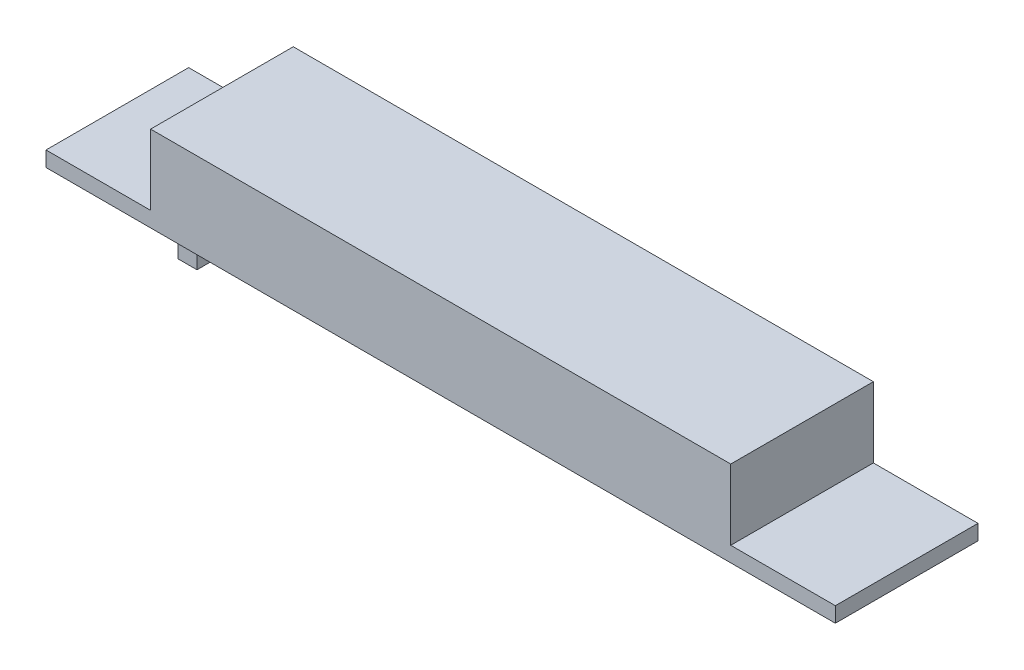
ISO-10303-21;
HEADER;
FILE_DESCRIPTION(('STEP AP214'),'2;1');
FILE_NAME('part.step','',(''),(''),'','','');
FILE_SCHEMA(('AUTOMOTIVE_DESIGN { 1 0 10303 214 1 1 1 1 }'));
ENDSEC;
DATA;
#1=APPLICATION_CONTEXT('core data for automotive mechanical design processes');
#2=APPLICATION_PROTOCOL_DEFINITION('international standard','automotive_design',2000,#1);
#3=PRODUCT_CONTEXT('',#1,'mechanical');
#4=PRODUCT('Part','Part','',(#3));
#5=PRODUCT_RELATED_PRODUCT_CATEGORY('part','',(#4));
#6=PRODUCT_DEFINITION_FORMATION('','',#4);
#7=PRODUCT_DEFINITION_CONTEXT('part definition',#1,'design');
#8=PRODUCT_DEFINITION('design','',#6,#7);
#9=PRODUCT_DEFINITION_SHAPE('','',#8);
#10=(LENGTH_UNIT() NAMED_UNIT(*) SI_UNIT(.MILLI.,.METRE.));
#11=(NAMED_UNIT(*) PLANE_ANGLE_UNIT() SI_UNIT($,.RADIAN.));
#12=(NAMED_UNIT(*) SI_UNIT($,.STERADIAN.) SOLID_ANGLE_UNIT());
#13=UNCERTAINTY_MEASURE_WITH_UNIT(LENGTH_MEASURE(1.E-05),#10,'distance_accuracy_value','');
#14=(GEOMETRIC_REPRESENTATION_CONTEXT(3) GLOBAL_UNCERTAINTY_ASSIGNED_CONTEXT((#13)) GLOBAL_UNIT_ASSIGNED_CONTEXT((#10,
#11,#12)) REPRESENTATION_CONTEXT('',''));
#15=CARTESIAN_POINT('',(0.,0.,0.));
#16=DIRECTION('',(0.,0.,1.));
#17=DIRECTION('',(1.,0.,0.));
#18=AXIS2_PLACEMENT_3D('',#15,#16,#17);
#19=CARTESIAN_POINT('',(0.,0.,0.));
#20=DIRECTION('',(0.,-1.,0.));
#21=DIRECTION('',(0.,0.,-1.));
#22=AXIS2_PLACEMENT_3D('',#19,#20,#21);
#23=PLANE('',#22);
#24=DIRECTION('',(0.,0.,-1.));
#25=VECTOR('',#24,1.);
#26=CARTESIAN_POINT('',(41.5,0.,7.5));
#27=LINE('',#26,#25);
#28=CARTESIAN_POINT('',(41.5,0.,7.5));
#29=VERTEX_POINT('',#28);
#30=CARTESIAN_POINT('',(41.5,0.,-7.5));
#31=VERTEX_POINT('',#30);
#32=EDGE_CURVE('E189',#29,#31,#27,.T.);
#33=ORIENTED_EDGE('',*,*,#32,.F.);
#34=DIRECTION('',(1.,0.,0.));
#35=VECTOR('',#34,1.);
#36=CARTESIAN_POINT('',(-41.5,0.,7.5));
#37=LINE('',#36,#35);
#38=CARTESIAN_POINT('',(-41.5,0.,7.5));
#39=VERTEX_POINT('',#38);
#40=EDGE_CURVE('E194',#39,#29,#37,.T.);
#41=ORIENTED_EDGE('',*,*,#40,.F.);
#42=DIRECTION('',(0.,0.,1.));
#43=VECTOR('',#42,1.);
#44=CARTESIAN_POINT('',(-41.5,0.,7.5));
#45=LINE('',#44,#43);
#46=CARTESIAN_POINT('',(-41.5,0.,-7.5));
#47=VERTEX_POINT('',#46);
#48=EDGE_CURVE('E207',#47,#39,#45,.T.);
#49=ORIENTED_EDGE('',*,*,#48,.F.);
#50=DIRECTION('',(-1.,0.,0.));
#51=VECTOR('',#50,1.);
#52=CARTESIAN_POINT('',(-41.5,0.,-7.5));
#53=LINE('',#52,#51);
#54=EDGE_CURVE('E205',#31,#47,#53,.T.);
#55=ORIENTED_EDGE('',*,*,#54,.F.);
#56=EDGE_LOOP('',(#33,#41,#49,#55));
#57=FACE_BOUND('',#56,.T.);
#58=DIRECTION('',(1.,0.,0.));
#59=VECTOR('',#58,1.);
#60=CARTESIAN_POINT('',(-26.5,0.,-6.62500000000001));
#61=LINE('',#60,#59);
#62=CARTESIAN_POINT('',(-28.5,0.,-6.62500000000001));
#63=VERTEX_POINT('',#62);
#64=CARTESIAN_POINT('',(-26.5,0.,-6.62500000000001));
#65=VERTEX_POINT('',#64);
#66=EDGE_CURVE('E389',#63,#65,#61,.T.);
#67=ORIENTED_EDGE('',*,*,#66,.F.);
#68=DIRECTION('',(0.,0.,-1.));
#69=VECTOR('',#68,1.);
#70=CARTESIAN_POINT('',(-28.5,0.,-6.62500000000001));
#71=LINE('',#70,#69);
#72=CARTESIAN_POINT('',(-28.5,0.,6.62499999999999));
#73=VERTEX_POINT('',#72);
#74=EDGE_CURVE('E154',#73,#63,#71,.T.);
#75=ORIENTED_EDGE('',*,*,#74,.F.);
#76=DIRECTION('',(-1.,0.,0.));
#77=VECTOR('',#76,1.);
#78=CARTESIAN_POINT('',(-26.5,0.,6.62499999999999));
#79=LINE('',#78,#77);
#80=CARTESIAN_POINT('',(-26.5,0.,6.62499999999999));
#81=VERTEX_POINT('',#80);
#82=EDGE_CURVE('E150',#81,#73,#79,.T.);
#83=ORIENTED_EDGE('',*,*,#82,.F.);
#84=DIRECTION('',(0.,0.,1.));
#85=VECTOR('',#84,1.);
#86=CARTESIAN_POINT('',(-26.5,0.,-6.62500000000001));
#87=LINE('',#86,#85);
#88=EDGE_CURVE('E386',#65,#81,#87,.T.);
#89=ORIENTED_EDGE('',*,*,#88,.F.);
#90=EDGE_LOOP('',(#67,#75,#83,#89));
#91=FACE_BOUND('',#90,.T.);
#92=ADVANCED_FACE('F41',(#57,#91),#23,.T.);
#93=CARTESIAN_POINT('',(0.,1.6,0.));
#94=DIRECTION('',(0.,-1.,0.));
#95=DIRECTION('',(0.,0.,-1.));
#96=AXIS2_PLACEMENT_3D('',#93,#94,#95);
#97=PLANE('',#96);
#98=DIRECTION('',(0.,0.,-1.));
#99=VECTOR('',#98,1.);
#100=CARTESIAN_POINT('',(30.5,1.6,7.50000000000001));
#101=LINE('',#100,#99);
#102=CARTESIAN_POINT('',(30.5,1.6,7.5));
#103=VERTEX_POINT('',#102);
#104=CARTESIAN_POINT('',(30.5,1.6,-7.5));
#105=VERTEX_POINT('',#104);
#106=EDGE_CURVE('E64',#103,#105,#101,.T.);
#107=ORIENTED_EDGE('',*,*,#106,.F.);
#108=DIRECTION('',(1.,0.,0.));
#109=VECTOR('',#108,1.);
#110=CARTESIAN_POINT('',(-41.5,1.6,7.5));
#111=LINE('',#110,#109);
#112=CARTESIAN_POINT('',(41.5,1.6,7.5));
#113=VERTEX_POINT('',#112);
#114=EDGE_CURVE('E199',#103,#113,#111,.T.);
#115=ORIENTED_EDGE('',*,*,#114,.T.);
#116=DIRECTION('',(0.,0.,-1.));
#117=VECTOR('',#116,1.);
#118=CARTESIAN_POINT('',(41.5,1.6,7.5));
#119=LINE('',#118,#117);
#120=CARTESIAN_POINT('',(41.5,1.6,-7.5));
#121=VERTEX_POINT('',#120);
#122=EDGE_CURVE('E190',#113,#121,#119,.T.);
#123=ORIENTED_EDGE('',*,*,#122,.T.);
#124=DIRECTION('',(-1.,0.,0.));
#125=VECTOR('',#124,1.);
#126=CARTESIAN_POINT('',(-41.5,1.6,-7.5));
#127=LINE('',#126,#125);
#128=EDGE_CURVE('E195',#121,#105,#127,.T.);
#129=ORIENTED_EDGE('',*,*,#128,.T.);
#130=EDGE_LOOP('',(#107,#115,#123,#129));
#131=FACE_BOUND('',#130,.T.);
#132=ADVANCED_FACE('F234',(#131),#97,.F.);
#133=DIRECTION('',(0.,0.,1.));
#134=VECTOR('',#133,1.);
#135=CARTESIAN_POINT('',(-30.5,1.6,7.5));
#136=LINE('',#135,#134);
#137=CARTESIAN_POINT('',(-30.5,1.6,-7.5));
#138=VERTEX_POINT('',#137);
#139=CARTESIAN_POINT('',(-30.5,1.6,7.5));
#140=VERTEX_POINT('',#139);
#141=EDGE_CURVE('E157',#138,#140,#136,.T.);
#142=ORIENTED_EDGE('',*,*,#141,.F.);
#143=CARTESIAN_POINT('',(-41.5,1.6,-7.5));
#144=VERTEX_POINT('',#143);
#145=EDGE_CURVE('E193',#138,#144,#127,.T.);
#146=ORIENTED_EDGE('',*,*,#145,.T.);
#147=DIRECTION('',(0.,0.,1.));
#148=VECTOR('',#147,1.);
#149=CARTESIAN_POINT('',(-41.5,1.6,7.5));
#150=LINE('',#149,#148);
#151=CARTESIAN_POINT('',(-41.5,1.6,7.5));
#152=VERTEX_POINT('',#151);
#153=EDGE_CURVE('E197',#144,#152,#150,.T.);
#154=ORIENTED_EDGE('',*,*,#153,.T.);
#155=EDGE_CURVE('E200',#152,#140,#111,.T.);
#156=ORIENTED_EDGE('',*,*,#155,.T.);
#157=EDGE_LOOP('',(#142,#146,#154,#156));
#158=FACE_BOUND('',#157,.T.);
#159=ADVANCED_FACE('F249',(#158),#97,.F.);
#160=CARTESIAN_POINT('',(41.5,1.6,7.5));
#161=DIRECTION('',(-1.,0.,0.));
#162=DIRECTION('',(0.,0.,1.));
#163=AXIS2_PLACEMENT_3D('',#160,#161,#162);
#164=PLANE('',#163);
#165=ORIENTED_EDGE('',*,*,#32,.T.);
#166=DIRECTION('',(0.,-1.,0.));
#167=VECTOR('',#166,1.);
#168=CARTESIAN_POINT('',(41.5,1.6,-7.5));
#169=LINE('',#168,#167);
#170=EDGE_CURVE('E11',#121,#31,#169,.T.);
#171=ORIENTED_EDGE('',*,*,#170,.F.);
#172=ORIENTED_EDGE('',*,*,#122,.F.);
#173=DIRECTION('',(0.,-1.,0.));
#174=VECTOR('',#173,1.);
#175=CARTESIAN_POINT('',(41.5,1.6,7.5));
#176=LINE('',#175,#174);
#177=EDGE_CURVE('E202',#113,#29,#176,.T.);
#178=ORIENTED_EDGE('',*,*,#177,.T.);
#179=EDGE_LOOP('',(#165,#171,#172,#178));
#180=FACE_BOUND('',#179,.T.);
#181=ADVANCED_FACE('F43',(#180),#164,.F.);
#182=CARTESIAN_POINT('',(-41.5,1.6,-7.5));
#183=DIRECTION('',(0.,0.,1.));
#184=DIRECTION('',(1.,0.,0.));
#185=AXIS2_PLACEMENT_3D('',#182,#183,#184);
#186=PLANE('',#185);
#187=ORIENTED_EDGE('',*,*,#54,.T.);
#188=DIRECTION('',(0.,-1.,0.));
#189=VECTOR('',#188,1.);
#190=CARTESIAN_POINT('',(-41.5,1.6,-7.5));
#191=LINE('',#190,#189);
#192=EDGE_CURVE('E49',#144,#47,#191,.T.);
#193=ORIENTED_EDGE('',*,*,#192,.F.);
#194=ORIENTED_EDGE('',*,*,#145,.F.);
#195=DIRECTION('',(0.,-1.,0.));
#196=VECTOR('',#195,1.);
#197=CARTESIAN_POINT('',(-30.5,9.,-7.5));
#198=LINE('',#197,#196);
#199=CARTESIAN_POINT('',(-30.5,9.,-7.5));
#200=VERTEX_POINT('',#199);
#201=EDGE_CURVE('E182',#200,#138,#198,.T.);
#202=ORIENTED_EDGE('',*,*,#201,.F.);
#203=DIRECTION('',(-1.,0.,0.));
#204=VECTOR('',#203,1.);
#205=CARTESIAN_POINT('',(-30.5,9.,-7.5));
#206=LINE('',#205,#204);
#207=CARTESIAN_POINT('',(30.5,9.,-7.5));
#208=VERTEX_POINT('',#207);
#209=EDGE_CURVE('E166',#208,#200,#206,.T.);
#210=ORIENTED_EDGE('',*,*,#209,.F.);
#211=DIRECTION('',(0.,-1.,0.));
#212=VECTOR('',#211,1.);
#213=CARTESIAN_POINT('',(30.5,9.,-7.5));
#214=LINE('',#213,#212);
#215=EDGE_CURVE('E185',#208,#105,#214,.T.);
#216=ORIENTED_EDGE('',*,*,#215,.T.);
#217=ORIENTED_EDGE('',*,*,#128,.F.);
#218=ORIENTED_EDGE('',*,*,#170,.T.);
#219=EDGE_LOOP('',(#187,#193,#194,#202,#210,#216,#217,#218));
#220=FACE_BOUND('',#219,.T.);
#221=ADVANCED_FACE('F250',(#220),#186,.F.);
#222=CARTESIAN_POINT('',(-41.5,1.6,7.5));
#223=DIRECTION('',(1.,0.,0.));
#224=DIRECTION('',(0.,0.,-1.));
#225=AXIS2_PLACEMENT_3D('',#222,#223,#224);
#226=PLANE('',#225);
#227=ORIENTED_EDGE('',*,*,#48,.T.);
#228=DIRECTION('',(0.,-1.,0.));
#229=VECTOR('',#228,1.);
#230=CARTESIAN_POINT('',(-41.5,1.6,7.5));
#231=LINE('',#230,#229);
#232=EDGE_CURVE('E212',#152,#39,#231,.T.);
#233=ORIENTED_EDGE('',*,*,#232,.F.);
#234=ORIENTED_EDGE('',*,*,#153,.F.);
#235=ORIENTED_EDGE('',*,*,#192,.T.);
#236=EDGE_LOOP('',(#227,#233,#234,#235));
#237=FACE_BOUND('',#236,.T.);
#238=ADVANCED_FACE('F219',(#237),#226,.F.);
#239=CARTESIAN_POINT('',(-41.5,1.6,7.5));
#240=DIRECTION('',(0.,0.,-1.));
#241=DIRECTION('',(-1.,0.,0.));
#242=AXIS2_PLACEMENT_3D('',#239,#240,#241);
#243=PLANE('',#242);
#244=ORIENTED_EDGE('',*,*,#40,.T.);
#245=ORIENTED_EDGE('',*,*,#177,.F.);
#246=ORIENTED_EDGE('',*,*,#114,.F.);
#247=DIRECTION('',(0.,-1.,0.));
#248=VECTOR('',#247,1.);
#249=CARTESIAN_POINT('',(30.5,9.,7.50000000000001));
#250=LINE('',#249,#248);
#251=CARTESIAN_POINT('',(30.5,9.,7.50000000000001));
#252=VERTEX_POINT('',#251);
#253=EDGE_CURVE('E173',#252,#103,#250,.T.);
#254=ORIENTED_EDGE('',*,*,#253,.F.);
#255=DIRECTION('',(1.,0.,0.));
#256=VECTOR('',#255,1.);
#257=CARTESIAN_POINT('',(-30.5,9.,7.5));
#258=LINE('',#257,#256);
#259=CARTESIAN_POINT('',(-30.5,9.,7.5));
#260=VERTEX_POINT('',#259);
#261=EDGE_CURVE('E171',#260,#252,#258,.T.);
#262=ORIENTED_EDGE('',*,*,#261,.F.);
#263=DIRECTION('',(0.,-1.,0.));
#264=VECTOR('',#263,1.);
#265=CARTESIAN_POINT('',(-30.5,9.,7.5));
#266=LINE('',#265,#264);
#267=EDGE_CURVE('E179',#260,#140,#266,.T.);
#268=ORIENTED_EDGE('',*,*,#267,.T.);
#269=ORIENTED_EDGE('',*,*,#155,.F.);
#270=ORIENTED_EDGE('',*,*,#232,.T.);
#271=EDGE_LOOP('',(#244,#245,#246,#254,#262,#268,#269,#270));
#272=FACE_BOUND('',#271,.T.);
#273=ADVANCED_FACE('F229',(#272),#243,.F.);
#274=CARTESIAN_POINT('',(30.5,9.,7.50000000000001));
#275=DIRECTION('',(-1.,0.,0.));
#276=DIRECTION('',(0.,0.,1.));
#277=AXIS2_PLACEMENT_3D('',#274,#275,#276);
#278=PLANE('',#277);
#279=ORIENTED_EDGE('',*,*,#106,.T.);
#280=ORIENTED_EDGE('',*,*,#215,.F.);
#281=DIRECTION('',(0.,0.,-1.));
#282=VECTOR('',#281,1.);
#283=CARTESIAN_POINT('',(30.5,9.,7.50000000000001));
#284=LINE('',#283,#282);
#285=EDGE_CURVE('E162',#252,#208,#284,.T.);
#286=ORIENTED_EDGE('',*,*,#285,.F.);
#287=ORIENTED_EDGE('',*,*,#253,.T.);
#288=EDGE_LOOP('',(#279,#280,#286,#287));
#289=FACE_BOUND('',#288,.T.);
#290=ADVANCED_FACE('F239',(#289),#278,.F.);
#291=CARTESIAN_POINT('',(-30.5,9.,7.5));
#292=DIRECTION('',(1.,0.,0.));
#293=DIRECTION('',(0.,0.,-1.));
#294=AXIS2_PLACEMENT_3D('',#291,#292,#293);
#295=PLANE('',#294);
#296=ORIENTED_EDGE('',*,*,#141,.T.);
#297=ORIENTED_EDGE('',*,*,#267,.F.);
#298=DIRECTION('',(0.,0.,1.));
#299=VECTOR('',#298,1.);
#300=CARTESIAN_POINT('',(-30.5,9.,7.5));
#301=LINE('',#300,#299);
#302=EDGE_CURVE('E169',#200,#260,#301,.T.);
#303=ORIENTED_EDGE('',*,*,#302,.F.);
#304=ORIENTED_EDGE('',*,*,#201,.T.);
#305=EDGE_LOOP('',(#296,#297,#303,#304));
#306=FACE_BOUND('',#305,.T.);
#307=ADVANCED_FACE('F247',(#306),#295,.F.);
#308=CARTESIAN_POINT('',(0.,9.,0.));
#309=DIRECTION('',(0.,-1.,0.));
#310=DIRECTION('',(0.,0.,-1.));
#311=AXIS2_PLACEMENT_3D('',#308,#309,#310);
#312=PLANE('',#311);
#313=ORIENTED_EDGE('',*,*,#285,.T.);
#314=ORIENTED_EDGE('',*,*,#209,.T.);
#315=ORIENTED_EDGE('',*,*,#302,.T.);
#316=ORIENTED_EDGE('',*,*,#261,.T.);
#317=EDGE_LOOP('',(#313,#314,#315,#316));
#318=FACE_BOUND('',#317,.T.);
#319=ADVANCED_FACE('F242',(#318),#312,.F.);
#320=CARTESIAN_POINT('',(-28.5,-2.25,-6.62500000000001));
#321=DIRECTION('',(1.,0.,0.));
#322=DIRECTION('',(0.,0.,-1.));
#323=AXIS2_PLACEMENT_3D('',#320,#321,#322);
#324=PLANE('',#323);
#325=ORIENTED_EDGE('',*,*,#74,.T.);
#326=DIRECTION('',(0.,1.,0.));
#327=VECTOR('',#326,1.);
#328=CARTESIAN_POINT('',(-28.5,-2.25,-6.62500000000001));
#329=LINE('',#328,#327);
#330=CARTESIAN_POINT('',(-28.5,-2.25,-6.62500000000001));
#331=VERTEX_POINT('',#330);
#332=EDGE_CURVE('E135',#331,#63,#329,.T.);
#333=ORIENTED_EDGE('',*,*,#332,.F.);
#334=DIRECTION('',(0.,0.,-1.));
#335=VECTOR('',#334,1.);
#336=CARTESIAN_POINT('',(-28.5,-2.25,-6.62500000000001));
#337=LINE('',#336,#335);
#338=CARTESIAN_POINT('',(-28.5,-2.25,6.62499999999999));
#339=VERTEX_POINT('',#338);
#340=EDGE_CURVE('E142',#339,#331,#337,.T.);
#341=ORIENTED_EDGE('',*,*,#340,.F.);
#342=DIRECTION('',(0.,1.,0.));
#343=VECTOR('',#342,1.);
#344=CARTESIAN_POINT('',(-28.5,-2.25,6.62499999999999));
#345=LINE('',#344,#343);
#346=EDGE_CURVE('E384',#339,#73,#345,.T.);
#347=ORIENTED_EDGE('',*,*,#346,.T.);
#348=EDGE_LOOP('',(#325,#333,#341,#347));
#349=FACE_BOUND('',#348,.T.);
#350=ADVANCED_FACE('F152',(#349),#324,.F.);
#351=CARTESIAN_POINT('',(-26.5,-2.25,-6.62500000000001));
#352=DIRECTION('',(0.,0.,1.));
#353=DIRECTION('',(1.,0.,0.));
#354=AXIS2_PLACEMENT_3D('',#351,#352,#353);
#355=PLANE('',#354);
#356=ORIENTED_EDGE('',*,*,#66,.T.);
#357=DIRECTION('',(0.,1.,0.));
#358=VECTOR('',#357,1.);
#359=CARTESIAN_POINT('',(-26.5,-2.25,-6.62500000000001));
#360=LINE('',#359,#358);
#361=CARTESIAN_POINT('',(-26.5,-2.25,-6.62500000000001));
#362=VERTEX_POINT('',#361);
#363=EDGE_CURVE('E138',#362,#65,#360,.T.);
#364=ORIENTED_EDGE('',*,*,#363,.F.);
#365=DIRECTION('',(1.,0.,0.));
#366=VECTOR('',#365,1.);
#367=CARTESIAN_POINT('',(-26.5,-2.25,-6.62500000000001));
#368=LINE('',#367,#366);
#369=EDGE_CURVE('E131',#331,#362,#368,.T.);
#370=ORIENTED_EDGE('',*,*,#369,.F.);
#371=ORIENTED_EDGE('',*,*,#332,.T.);
#372=EDGE_LOOP('',(#356,#364,#370,#371));
#373=FACE_BOUND('',#372,.T.);
#374=ADVANCED_FACE('F133',(#373),#355,.F.);
#375=CARTESIAN_POINT('',(-26.5,-2.25,-6.62500000000001));
#376=DIRECTION('',(-1.,0.,0.));
#377=DIRECTION('',(0.,0.,1.));
#378=AXIS2_PLACEMENT_3D('',#375,#376,#377);
#379=PLANE('',#378);
#380=ORIENTED_EDGE('',*,*,#88,.T.);
#381=DIRECTION('',(0.,1.,0.));
#382=VECTOR('',#381,1.);
#383=CARTESIAN_POINT('',(-26.5,-2.25,6.62499999999999));
#384=LINE('',#383,#382);
#385=CARTESIAN_POINT('',(-26.5,-2.25,6.62499999999999));
#386=VERTEX_POINT('',#385);
#387=EDGE_CURVE('E56',#386,#81,#384,.T.);
#388=ORIENTED_EDGE('',*,*,#387,.F.);
#389=DIRECTION('',(0.,0.,1.));
#390=VECTOR('',#389,1.);
#391=CARTESIAN_POINT('',(-26.5,-2.25,-6.62500000000001));
#392=LINE('',#391,#390);
#393=EDGE_CURVE('E141',#362,#386,#392,.T.);
#394=ORIENTED_EDGE('',*,*,#393,.F.);
#395=ORIENTED_EDGE('',*,*,#363,.T.);
#396=EDGE_LOOP('',(#380,#388,#394,#395));
#397=FACE_BOUND('',#396,.T.);
#398=ADVANCED_FACE('F280',(#397),#379,.F.);
#399=CARTESIAN_POINT('',(-26.5,-2.25,6.62499999999999));
#400=DIRECTION('',(0.,0.,-1.));
#401=DIRECTION('',(-1.,0.,0.));
#402=AXIS2_PLACEMENT_3D('',#399,#400,#401);
#403=PLANE('',#402);
#404=ORIENTED_EDGE('',*,*,#82,.T.);
#405=ORIENTED_EDGE('',*,*,#346,.F.);
#406=DIRECTION('',(-1.,0.,0.));
#407=VECTOR('',#406,1.);
#408=CARTESIAN_POINT('',(-26.5,-2.25,6.62499999999999));
#409=LINE('',#408,#407);
#410=EDGE_CURVE('E146',#386,#339,#409,.T.);
#411=ORIENTED_EDGE('',*,*,#410,.F.);
#412=ORIENTED_EDGE('',*,*,#387,.T.);
#413=EDGE_LOOP('',(#404,#405,#411,#412));
#414=FACE_BOUND('',#413,.T.);
#415=ADVANCED_FACE('F283',(#414),#403,.F.);
#416=CARTESIAN_POINT('',(0.,-2.25,0.));
#417=DIRECTION('',(0.,-1.,0.));
#418=DIRECTION('',(0.,0.,-1.));
#419=AXIS2_PLACEMENT_3D('',#416,#417,#418);
#420=PLANE('',#419);
#421=ORIENTED_EDGE('',*,*,#340,.T.);
#422=ORIENTED_EDGE('',*,*,#369,.T.);
#423=ORIENTED_EDGE('',*,*,#393,.T.);
#424=ORIENTED_EDGE('',*,*,#410,.T.);
#425=EDGE_LOOP('',(#421,#422,#423,#424));
#426=FACE_BOUND('',#425,.T.);
#427=ADVANCED_FACE('F145',(#426),#420,.T.);
#428=CLOSED_SHELL('',(#92,#132,#159,#181,#221,#238,#273,#290,#307,#319,#350,#374,#398,#415,#427));
#429=MANIFOLD_SOLID_BREP('B2',#428);
#430=ADVANCED_BREP_SHAPE_REPRESENTATION('',(#18,#429),#14);
#431=SHAPE_DEFINITION_REPRESENTATION(#9,#430);
ENDSEC;
END-ISO-10303-21;
